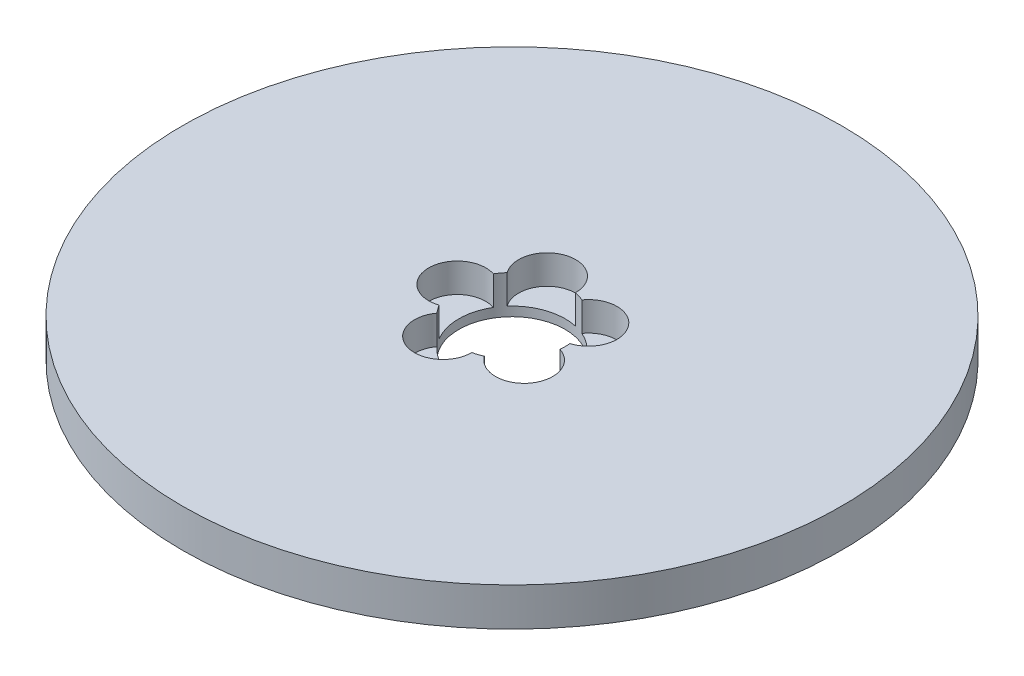
ISO-10303-21;
HEADER;
FILE_DESCRIPTION(('STEP AP214'),'2;1');
FILE_NAME('part.step','',(''),(''),'','','');
FILE_SCHEMA(('AUTOMOTIVE_DESIGN { 1 0 10303 214 1 1 1 1 }'));
ENDSEC;
DATA;
#1=APPLICATION_CONTEXT('core data for automotive mechanical design processes');
#2=APPLICATION_PROTOCOL_DEFINITION('international standard','automotive_design',2000,#1);
#3=PRODUCT_CONTEXT('',#1,'mechanical');
#4=PRODUCT('Part','Part','',(#3));
#5=PRODUCT_RELATED_PRODUCT_CATEGORY('part','',(#4));
#6=PRODUCT_DEFINITION_FORMATION('','',#4);
#7=PRODUCT_DEFINITION_CONTEXT('part definition',#1,'design');
#8=PRODUCT_DEFINITION('design','',#6,#7);
#9=PRODUCT_DEFINITION_SHAPE('','',#8);
#10=(LENGTH_UNIT() NAMED_UNIT(*) SI_UNIT(.MILLI.,.METRE.));
#11=(NAMED_UNIT(*) PLANE_ANGLE_UNIT() SI_UNIT($,.RADIAN.));
#12=(NAMED_UNIT(*) SI_UNIT($,.STERADIAN.) SOLID_ANGLE_UNIT());
#13=UNCERTAINTY_MEASURE_WITH_UNIT(LENGTH_MEASURE(1.E-05),#10,'distance_accuracy_value','');
#14=(GEOMETRIC_REPRESENTATION_CONTEXT(3) GLOBAL_UNCERTAINTY_ASSIGNED_CONTEXT((#13)) GLOBAL_UNIT_ASSIGNED_CONTEXT((#10,
#11,#12)) REPRESENTATION_CONTEXT('',''));
#15=CARTESIAN_POINT('',(0.,0.,0.));
#16=DIRECTION('',(0.,0.,1.));
#17=DIRECTION('',(1.,0.,0.));
#18=AXIS2_PLACEMENT_3D('',#15,#16,#17);
#19=CARTESIAN_POINT('',(0.,9.,0.));
#20=DIRECTION('',(0.,-1.,0.));
#21=DIRECTION('',(0.,0.,-1.));
#22=AXIS2_PLACEMENT_3D('',#19,#20,#21);
#23=CYLINDRICAL_SURFACE('',#22,77.5);
#24=CARTESIAN_POINT('',(0.,9.,0.));
#25=DIRECTION('',(0.,1.,0.));
#26=DIRECTION('',(0.,0.,1.));
#27=AXIS2_PLACEMENT_3D('',#24,#25,#26);
#28=CIRCLE('',#27,77.5);
#29=CARTESIAN_POINT('',(0.,9.,77.5));
#30=VERTEX_POINT('',#29);
#31=EDGE_CURVE('E157',#30,#30,#28,.T.);
#32=ORIENTED_EDGE('',*,*,#31,.F.);
#33=EDGE_LOOP('',(#32));
#34=FACE_BOUND('',#33,.T.);
#35=CARTESIAN_POINT('',(0.,0.,0.));
#36=DIRECTION('',(0.,1.,0.));
#37=DIRECTION('',(0.,0.,1.));
#38=AXIS2_PLACEMENT_3D('',#35,#36,#37);
#39=CIRCLE('',#38,77.5);
#40=CARTESIAN_POINT('',(0.,0.,77.5));
#41=VERTEX_POINT('',#40);
#42=EDGE_CURVE('E150',#41,#41,#39,.T.);
#43=ORIENTED_EDGE('',*,*,#42,.T.);
#44=EDGE_LOOP('',(#43));
#45=FACE_BOUND('',#44,.T.);
#46=ADVANCED_FACE('F39',(#34,#45),#23,.T.);
#47=CARTESIAN_POINT('',(0.,9.,0.));
#48=DIRECTION('',(0.,1.,0.));
#49=DIRECTION('',(0.,0.,1.));
#50=AXIS2_PLACEMENT_3D('',#47,#48,#49);
#51=PLANE('',#50);
#52=CARTESIAN_POINT('',(-3.97791265532245,9.,-12.2427562916065));
#53=DIRECTION('',(0.,1.,0.));
#54=DIRECTION('',(-0.95105651629515,0.,0.309016994374958));
#55=AXIS2_PLACEMENT_3D('',#52,#53,#54);
#56=CIRCLE('',#55,6.7158586883023);
#57=CARTESIAN_POINT('',(2.73778670824322,9.,-12.1964963797054));
#58=VERTEX_POINT('',#57);
#59=CARTESIAN_POINT('',(-9.38383667557217,9.,-8.25794219198625));
#60=VERTEX_POINT('',#59);
#61=EDGE_CURVE('E194',#58,#60,#56,.T.);
#62=ORIENTED_EDGE('',*,*,#61,.F.);
#63=CARTESIAN_POINT('',(0.,9.,0.));
#64=DIRECTION('',(0.,1.,0.));
#65=DIRECTION('',(0.,0.,1.));
#66=AXIS2_PLACEMENT_3D('',#63,#64,#65);
#67=CIRCLE('',#66,12.5);
#68=CARTESIAN_POINT('',(4.95400472768653,9.,-11.476403494042));
#69=VERTEX_POINT('',#68);
#70=EDGE_CURVE('E147',#69,#58,#67,.T.);
#71=ORIENTED_EDGE('',*,*,#70,.F.);
#72=CARTESIAN_POINT('',(10.4143105359121,9.,-7.56643950419458));
#73=DIRECTION('',(0.,1.,0.));
#74=DIRECTION('',(-0.58778525229248,0.,-0.809016994374942));
#75=AXIS2_PLACEMENT_3D('',#72,#73,#74);
#76=CIRCLE('',#75,6.7158586883023);
#77=CARTESIAN_POINT('',(12.4455799777101,9.,-1.16513476406048));
#78=VERTEX_POINT('',#77);
#79=EDGE_CURVE('E254',#78,#69,#76,.T.);
#80=ORIENTED_EDGE('',*,*,#79,.F.);
#81=CARTESIAN_POINT('',(12.4455799777101,9.,1.1651347640603));
#82=VERTEX_POINT('',#81);
#83=EDGE_CURVE('E144',#82,#78,#67,.T.);
#84=ORIENTED_EDGE('',*,*,#83,.F.);
#85=CARTESIAN_POINT('',(10.4143105359122,9.,7.56643950419443));
#86=DIRECTION('',(0.,1.,0.));
#87=DIRECTION('',(0.587785252292469,0.,-0.809016994374951));
#88=AXIS2_PLACEMENT_3D('',#85,#86,#87);
#89=CIRCLE('',#88,6.7158586883023);
#90=CARTESIAN_POINT('',(4.95400472768669,9.,11.4764034940419));
#91=VERTEX_POINT('',#90);
#92=EDGE_CURVE('E141',#91,#82,#89,.T.);
#93=ORIENTED_EDGE('',*,*,#92,.F.);
#94=CARTESIAN_POINT('',(2.73778670824339,9.,12.1964963797054));
#95=VERTEX_POINT('',#94);
#96=EDGE_CURVE('E134',#95,#91,#67,.T.);
#97=ORIENTED_EDGE('',*,*,#96,.F.);
#98=CARTESIAN_POINT('',(-3.97791265532228,9.,12.2427562916066));
#99=DIRECTION('',(0.,1.,0.));
#100=DIRECTION('',(0.951056516295155,0.,0.309016994374945));
#101=AXIS2_PLACEMENT_3D('',#98,#99,#100);
#102=CIRCLE('',#101,6.7158586883023);
#103=CARTESIAN_POINT('',(-9.38383667557205,9.,8.25794219198638));
#104=VERTEX_POINT('',#103);
#105=EDGE_CURVE('E111',#104,#95,#102,.T.);
#106=ORIENTED_EDGE('',*,*,#105,.F.);
#107=CARTESIAN_POINT('',(-10.753534738068,9.,6.37271454226259));
#108=VERTEX_POINT('',#107);
#109=EDGE_CURVE('E145',#108,#104,#67,.T.);
#110=ORIENTED_EDGE('',*,*,#109,.F.);
#111=CARTESIAN_POINT('',(-12.8727957611797,9.,0.));
#112=DIRECTION('',(0.,1.,0.));
#113=DIRECTION('',(0.,0.,1.));
#114=AXIS2_PLACEMENT_3D('',#111,#112,#113);
#115=CIRCLE('',#114,6.7158586883023);
#116=CARTESIAN_POINT('',(-10.753534738068,9.,-6.37271454226259));
#117=VERTEX_POINT('',#116);
#118=EDGE_CURVE('E153',#117,#108,#115,.T.);
#119=ORIENTED_EDGE('',*,*,#118,.F.);
#120=EDGE_CURVE('E146',#60,#117,#67,.T.);
#121=ORIENTED_EDGE('',*,*,#120,.F.);
#122=EDGE_LOOP('',(#62,#71,#80,#84,#93,#97,#106,#110,#119,#121));
#123=FACE_BOUND('',#122,.T.);
#124=ORIENTED_EDGE('',*,*,#31,.T.);
#125=EDGE_LOOP('',(#124));
#126=FACE_BOUND('',#125,.T.);
#127=ADVANCED_FACE('F139',(#123,#126),#51,.T.);
#128=CARTESIAN_POINT('',(0.,0.,0.));
#129=DIRECTION('',(0.,1.,0.));
#130=DIRECTION('',(0.,0.,1.));
#131=AXIS2_PLACEMENT_3D('',#128,#129,#130);
#132=PLANE('',#131);
#133=CARTESIAN_POINT('',(0.,0.,0.));
#134=DIRECTION('',(0.,1.,0.));
#135=DIRECTION('',(0.,0.,1.));
#136=AXIS2_PLACEMENT_3D('',#133,#134,#135);
#137=CIRCLE('',#136,12.5);
#138=CARTESIAN_POINT('',(0.,0.,12.5));
#139=VERTEX_POINT('',#138);
#140=EDGE_CURVE('E154',#139,#139,#137,.T.);
#141=ORIENTED_EDGE('',*,*,#140,.T.);
#142=EDGE_LOOP('',(#141));
#143=FACE_BOUND('',#142,.T.);
#144=ORIENTED_EDGE('',*,*,#42,.F.);
#145=EDGE_LOOP('',(#144));
#146=FACE_BOUND('',#145,.T.);
#147=ADVANCED_FACE('F213',(#143,#146),#132,.F.);
#148=CARTESIAN_POINT('',(0.,9.,0.));
#149=DIRECTION('',(0.,-1.,0.));
#150=DIRECTION('',(0.,0.,-1.));
#151=AXIS2_PLACEMENT_3D('',#148,#149,#150);
#152=CYLINDRICAL_SURFACE('',#151,12.5);
#153=DIRECTION('',(0.,1.,0.));
#154=VECTOR('',#153,1.);
#155=CARTESIAN_POINT('',(2.73778670824322,5.58579216612406,-12.1964963797054));
#156=LINE('',#155,#154);
#157=CARTESIAN_POINT('',(2.73778670824322,2.17158433224812,-12.1964963797054));
#158=VERTEX_POINT('',#157);
#159=EDGE_CURVE('E11',#158,#58,#156,.T.);
#160=ORIENTED_EDGE('',*,*,#159,.F.);
#161=CARTESIAN_POINT('',(0.,2.17158433224812,0.));
#162=DIRECTION('',(0.,1.,0.));
#163=DIRECTION('',(0.,0.,1.));
#164=AXIS2_PLACEMENT_3D('',#161,#162,#163);
#165=CIRCLE('',#164,12.5);
#166=CARTESIAN_POINT('',(-9.38383667557217,2.17158433224812,-8.25794219198625));
#167=VERTEX_POINT('',#166);
#168=EDGE_CURVE('E189',#158,#167,#165,.T.);
#169=ORIENTED_EDGE('',*,*,#168,.T.);
#170=DIRECTION('',(0.,1.,0.));
#171=VECTOR('',#170,1.);
#172=CARTESIAN_POINT('',(-9.38383667557217,5.58579216612406,-8.25794219198625));
#173=LINE('',#172,#171);
#174=EDGE_CURVE('E46',#60,#167,#173,.F.);
#175=ORIENTED_EDGE('',*,*,#174,.F.);
#176=ORIENTED_EDGE('',*,*,#120,.T.);
#177=DIRECTION('',(0.,1.,0.));
#178=VECTOR('',#177,1.);
#179=CARTESIAN_POINT('',(-10.753534738068,5.58579216612406,-6.37271454226259));
#180=LINE('',#179,#178);
#181=CARTESIAN_POINT('',(-10.753534738068,2.17158433224812,-6.37271454226259));
#182=VERTEX_POINT('',#181);
#183=EDGE_CURVE('E168',#182,#117,#180,.T.);
#184=ORIENTED_EDGE('',*,*,#183,.F.);
#185=CARTESIAN_POINT('',(0.,2.17158433224812,0.));
#186=DIRECTION('',(0.,1.,0.));
#187=DIRECTION('',(0.,0.,1.));
#188=AXIS2_PLACEMENT_3D('',#185,#186,#187);
#189=CIRCLE('',#188,12.5);
#190=CARTESIAN_POINT('',(-10.753534738068,2.17158433224812,6.37271454226259));
#191=VERTEX_POINT('',#190);
#192=EDGE_CURVE('E165',#182,#191,#189,.T.);
#193=ORIENTED_EDGE('',*,*,#192,.T.);
#194=DIRECTION('',(0.,1.,0.));
#195=VECTOR('',#194,1.);
#196=CARTESIAN_POINT('',(-10.753534738068,5.58579216612406,6.37271454226259));
#197=LINE('',#196,#195);
#198=EDGE_CURVE('E170',#108,#191,#197,.F.);
#199=ORIENTED_EDGE('',*,*,#198,.F.);
#200=ORIENTED_EDGE('',*,*,#109,.T.);
#201=DIRECTION('',(0.,1.,0.));
#202=VECTOR('',#201,1.);
#203=CARTESIAN_POINT('',(-9.38383667557205,5.58579216612406,8.25794219198638));
#204=LINE('',#203,#202);
#205=CARTESIAN_POINT('',(-9.38383667557205,2.17158433224812,8.25794219198638));
#206=VERTEX_POINT('',#205);
#207=EDGE_CURVE('E121',#206,#104,#204,.T.);
#208=ORIENTED_EDGE('',*,*,#207,.F.);
#209=CARTESIAN_POINT('',(0.,2.17158433224812,0.));
#210=DIRECTION('',(0.,1.,0.));
#211=DIRECTION('',(0.,0.,1.));
#212=AXIS2_PLACEMENT_3D('',#209,#210,#211);
#213=CIRCLE('',#212,12.5);
#214=CARTESIAN_POINT('',(2.73778670824339,2.17158433224812,12.1964963797054));
#215=VERTEX_POINT('',#214);
#216=EDGE_CURVE('E136',#206,#215,#213,.T.);
#217=ORIENTED_EDGE('',*,*,#216,.T.);
#218=DIRECTION('',(0.,1.,0.));
#219=VECTOR('',#218,1.);
#220=CARTESIAN_POINT('',(2.7377867082434,5.58579216612406,12.1964963797054));
#221=LINE('',#220,#219);
#222=EDGE_CURVE('E117',#95,#215,#221,.F.);
#223=ORIENTED_EDGE('',*,*,#222,.F.);
#224=ORIENTED_EDGE('',*,*,#96,.T.);
#225=DIRECTION('',(0.,1.,0.));
#226=VECTOR('',#225,1.);
#227=CARTESIAN_POINT('',(4.95400472768669,5.58579216612406,11.4764034940419));
#228=LINE('',#227,#226);
#229=CARTESIAN_POINT('',(4.95400472768669,2.17158433224812,11.4764034940419));
#230=VERTEX_POINT('',#229);
#231=EDGE_CURVE('E182',#230,#91,#228,.T.);
#232=ORIENTED_EDGE('',*,*,#231,.F.);
#233=CARTESIAN_POINT('',(0.,2.17158433224812,0.));
#234=DIRECTION('',(0.,1.,0.));
#235=DIRECTION('',(0.,0.,1.));
#236=AXIS2_PLACEMENT_3D('',#233,#234,#235);
#237=CIRCLE('',#236,12.5);
#238=CARTESIAN_POINT('',(12.4455799777101,2.17158433224812,1.1651347640603));
#239=VERTEX_POINT('',#238);
#240=EDGE_CURVE('E174',#230,#239,#237,.T.);
#241=ORIENTED_EDGE('',*,*,#240,.T.);
#242=DIRECTION('',(0.,1.,0.));
#243=VECTOR('',#242,1.);
#244=CARTESIAN_POINT('',(12.4455799777101,5.58579216612406,1.1651347640603));
#245=LINE('',#244,#243);
#246=EDGE_CURVE('E177',#82,#239,#245,.F.);
#247=ORIENTED_EDGE('',*,*,#246,.F.);
#248=ORIENTED_EDGE('',*,*,#83,.T.);
#249=DIRECTION('',(0.,1.,0.));
#250=VECTOR('',#249,1.);
#251=CARTESIAN_POINT('',(12.4455799777101,5.58579216612406,-1.16513476406048));
#252=LINE('',#251,#250);
#253=CARTESIAN_POINT('',(12.4455799777101,2.17158433224812,-1.16513476406048));
#254=VERTEX_POINT('',#253);
#255=EDGE_CURVE('E187',#254,#78,#252,.T.);
#256=ORIENTED_EDGE('',*,*,#255,.F.);
#257=CARTESIAN_POINT('',(0.,2.17158433224812,0.));
#258=DIRECTION('',(0.,1.,0.));
#259=DIRECTION('',(0.,0.,1.));
#260=AXIS2_PLACEMENT_3D('',#257,#258,#259);
#261=CIRCLE('',#260,12.5);
#262=CARTESIAN_POINT('',(4.95400472768653,2.17158433224812,-11.476403494042));
#263=VERTEX_POINT('',#262);
#264=EDGE_CURVE('E181',#254,#263,#261,.T.);
#265=ORIENTED_EDGE('',*,*,#264,.T.);
#266=DIRECTION('',(0.,1.,0.));
#267=VECTOR('',#266,1.);
#268=CARTESIAN_POINT('',(4.95400472768652,5.58579216612406,-11.476403494042));
#269=LINE('',#268,#267);
#270=EDGE_CURVE('E186',#69,#263,#269,.F.);
#271=ORIENTED_EDGE('',*,*,#270,.F.);
#272=ORIENTED_EDGE('',*,*,#70,.T.);
#273=EDGE_LOOP('',(#160,#169,#175,#176,#184,#193,#199,#200,#208,#217,#223,#224,#232,#241,#247,
#248,#256,#265,#271,#272));
#274=FACE_BOUND('',#273,.T.);
#275=ORIENTED_EDGE('',*,*,#140,.F.);
#276=EDGE_LOOP('',(#275));
#277=FACE_BOUND('',#276,.T.);
#278=ADVANCED_FACE('F135',(#274,#277),#152,.F.);
#279=CARTESIAN_POINT('',(-12.8727957611797,2.17158433224812,0.));
#280=DIRECTION('',(0.,1.,0.));
#281=DIRECTION('',(0.,0.,1.));
#282=AXIS2_PLACEMENT_3D('',#279,#280,#281);
#283=CYLINDRICAL_SURFACE('',#282,6.7158586883023);
#284=ORIENTED_EDGE('',*,*,#183,.T.);
#285=ORIENTED_EDGE('',*,*,#118,.T.);
#286=ORIENTED_EDGE('',*,*,#198,.T.);
#287=CARTESIAN_POINT('',(-12.8727957611797,2.17158433224812,0.));
#288=DIRECTION('',(0.,1.,0.));
#289=DIRECTION('',(0.,0.,1.));
#290=AXIS2_PLACEMENT_3D('',#287,#288,#289);
#291=CIRCLE('',#290,6.7158586883023);
#292=EDGE_CURVE('E158',#182,#191,#291,.T.);
#293=ORIENTED_EDGE('',*,*,#292,.F.);
#294=EDGE_LOOP('',(#284,#285,#286,#293));
#295=FACE_BOUND('',#294,.T.);
#296=ADVANCED_FACE('F221',(#295),#283,.F.);
#297=CARTESIAN_POINT('',(-12.8727957611797,2.17158433224812,0.));
#298=DIRECTION('',(0.,1.,0.));
#299=DIRECTION('',(0.,0.,1.));
#300=AXIS2_PLACEMENT_3D('',#297,#298,#299);
#301=PLANE('',#300);
#302=ORIENTED_EDGE('',*,*,#292,.T.);
#303=ORIENTED_EDGE('',*,*,#192,.F.);
#304=EDGE_LOOP('',(#302,#303));
#305=FACE_BOUND('',#304,.T.);
#306=ADVANCED_FACE('F227',(#305),#301,.T.);
#307=CARTESIAN_POINT('',(-3.97791265532228,2.17158433224812,12.2427562916066));
#308=DIRECTION('',(0.,1.,0.));
#309=DIRECTION('',(0.,0.,1.));
#310=AXIS2_PLACEMENT_3D('',#307,#308,#309);
#311=CYLINDRICAL_SURFACE('',#310,6.7158586883023);
#312=ORIENTED_EDGE('',*,*,#207,.T.);
#313=ORIENTED_EDGE('',*,*,#105,.T.);
#314=ORIENTED_EDGE('',*,*,#222,.T.);
#315=CARTESIAN_POINT('',(-3.97791265532228,2.17158433224812,12.2427562916066));
#316=DIRECTION('',(0.,1.,0.));
#317=DIRECTION('',(0.951056516295155,0.,0.309016994374945));
#318=AXIS2_PLACEMENT_3D('',#315,#316,#317);
#319=CIRCLE('',#318,6.7158586883023);
#320=EDGE_CURVE('E127',#206,#215,#319,.T.);
#321=ORIENTED_EDGE('',*,*,#320,.F.);
#322=EDGE_LOOP('',(#312,#313,#314,#321));
#323=FACE_BOUND('',#322,.T.);
#324=ADVANCED_FACE('F116',(#323),#311,.F.);
#325=CARTESIAN_POINT('',(-3.97791265532228,2.17158433224812,12.2427562916066));
#326=DIRECTION('',(0.,1.,0.));
#327=DIRECTION('',(0.951056516295155,0.,0.309016994374945));
#328=AXIS2_PLACEMENT_3D('',#325,#326,#327);
#329=PLANE('',#328);
#330=ORIENTED_EDGE('',*,*,#320,.T.);
#331=ORIENTED_EDGE('',*,*,#216,.F.);
#332=EDGE_LOOP('',(#330,#331));
#333=FACE_BOUND('',#332,.T.);
#334=ADVANCED_FACE('F234',(#333),#329,.T.);
#335=CARTESIAN_POINT('',(10.4143105359122,2.17158433224812,7.56643950419443));
#336=DIRECTION('',(0.,1.,0.));
#337=DIRECTION('',(0.,0.,1.));
#338=AXIS2_PLACEMENT_3D('',#335,#336,#337);
#339=CYLINDRICAL_SURFACE('',#338,6.7158586883023);
#340=ORIENTED_EDGE('',*,*,#231,.T.);
#341=ORIENTED_EDGE('',*,*,#92,.T.);
#342=ORIENTED_EDGE('',*,*,#246,.T.);
#343=CARTESIAN_POINT('',(10.4143105359122,2.17158433224812,7.56643950419443));
#344=DIRECTION('',(0.,1.,0.));
#345=DIRECTION('',(0.587785252292469,0.,-0.809016994374951));
#346=AXIS2_PLACEMENT_3D('',#343,#344,#345);
#347=CIRCLE('',#346,6.7158586883023);
#348=EDGE_CURVE('E130',#230,#239,#347,.T.);
#349=ORIENTED_EDGE('',*,*,#348,.F.);
#350=EDGE_LOOP('',(#340,#341,#342,#349));
#351=FACE_BOUND('',#350,.T.);
#352=ADVANCED_FACE('F240',(#351),#339,.F.);
#353=CARTESIAN_POINT('',(10.4143105359122,2.17158433224812,7.56643950419443));
#354=DIRECTION('',(0.,1.,0.));
#355=DIRECTION('',(0.587785252292469,0.,-0.809016994374951));
#356=AXIS2_PLACEMENT_3D('',#353,#354,#355);
#357=PLANE('',#356);
#358=ORIENTED_EDGE('',*,*,#348,.T.);
#359=ORIENTED_EDGE('',*,*,#240,.F.);
#360=EDGE_LOOP('',(#358,#359));
#361=FACE_BOUND('',#360,.T.);
#362=ADVANCED_FACE('F245',(#361),#357,.T.);
#363=CARTESIAN_POINT('',(10.4143105359121,2.17158433224812,-7.56643950419458));
#364=DIRECTION('',(0.,1.,0.));
#365=DIRECTION('',(0.,0.,1.));
#366=AXIS2_PLACEMENT_3D('',#363,#364,#365);
#367=CYLINDRICAL_SURFACE('',#366,6.7158586883023);
#368=ORIENTED_EDGE('',*,*,#255,.T.);
#369=ORIENTED_EDGE('',*,*,#79,.T.);
#370=ORIENTED_EDGE('',*,*,#270,.T.);
#371=CARTESIAN_POINT('',(10.4143105359121,2.17158433224812,-7.56643950419458));
#372=DIRECTION('',(0.,1.,0.));
#373=DIRECTION('',(-0.58778525229248,0.,-0.809016994374942));
#374=AXIS2_PLACEMENT_3D('',#371,#372,#373);
#375=CIRCLE('',#374,6.7158586883023);
#376=EDGE_CURVE('E56',#254,#263,#375,.T.);
#377=ORIENTED_EDGE('',*,*,#376,.F.);
#378=EDGE_LOOP('',(#368,#369,#370,#377));
#379=FACE_BOUND('',#378,.T.);
#380=ADVANCED_FACE('F266',(#379),#367,.F.);
#381=CARTESIAN_POINT('',(10.4143105359121,2.17158433224812,-7.56643950419458));
#382=DIRECTION('',(0.,1.,0.));
#383=DIRECTION('',(-0.58778525229248,0.,-0.809016994374942));
#384=AXIS2_PLACEMENT_3D('',#381,#382,#383);
#385=PLANE('',#384);
#386=ORIENTED_EDGE('',*,*,#376,.T.);
#387=ORIENTED_EDGE('',*,*,#264,.F.);
#388=EDGE_LOOP('',(#386,#387));
#389=FACE_BOUND('',#388,.T.);
#390=ADVANCED_FACE('F204',(#389),#385,.T.);
#391=CARTESIAN_POINT('',(-3.97791265532245,2.17158433224812,-12.2427562916065));
#392=DIRECTION('',(0.,1.,0.));
#393=DIRECTION('',(0.,0.,1.));
#394=AXIS2_PLACEMENT_3D('',#391,#392,#393);
#395=CYLINDRICAL_SURFACE('',#394,6.7158586883023);
#396=ORIENTED_EDGE('',*,*,#159,.T.);
#397=ORIENTED_EDGE('',*,*,#61,.T.);
#398=ORIENTED_EDGE('',*,*,#174,.T.);
#399=CARTESIAN_POINT('',(-3.97791265532245,2.17158433224812,-12.2427562916065));
#400=DIRECTION('',(0.,1.,0.));
#401=DIRECTION('',(-0.95105651629515,0.,0.309016994374958));
#402=AXIS2_PLACEMENT_3D('',#399,#400,#401);
#403=CIRCLE('',#402,6.7158586883023);
#404=EDGE_CURVE('E55',#158,#167,#403,.T.);
#405=ORIENTED_EDGE('',*,*,#404,.F.);
#406=EDGE_LOOP('',(#396,#397,#398,#405));
#407=FACE_BOUND('',#406,.T.);
#408=ADVANCED_FACE('F193',(#407),#395,.F.);
#409=CARTESIAN_POINT('',(-3.97791265532245,2.17158433224812,-12.2427562916065));
#410=DIRECTION('',(0.,1.,0.));
#411=DIRECTION('',(-0.95105651629515,0.,0.309016994374958));
#412=AXIS2_PLACEMENT_3D('',#409,#410,#411);
#413=PLANE('',#412);
#414=ORIENTED_EDGE('',*,*,#404,.T.);
#415=ORIENTED_EDGE('',*,*,#168,.F.);
#416=EDGE_LOOP('',(#414,#415));
#417=FACE_BOUND('',#416,.T.);
#418=ADVANCED_FACE('F196',(#417),#413,.T.);
#419=CLOSED_SHELL('',(#46,#127,#147,#278,#296,#306,#324,#334,#352,#362,#380,#390,#408,#418));
#420=MANIFOLD_SOLID_BREP('B2',#419);
#421=ADVANCED_BREP_SHAPE_REPRESENTATION('',(#18,#420),#14);
#422=SHAPE_DEFINITION_REPRESENTATION(#9,#421);
ENDSEC;
END-ISO-10303-21;
